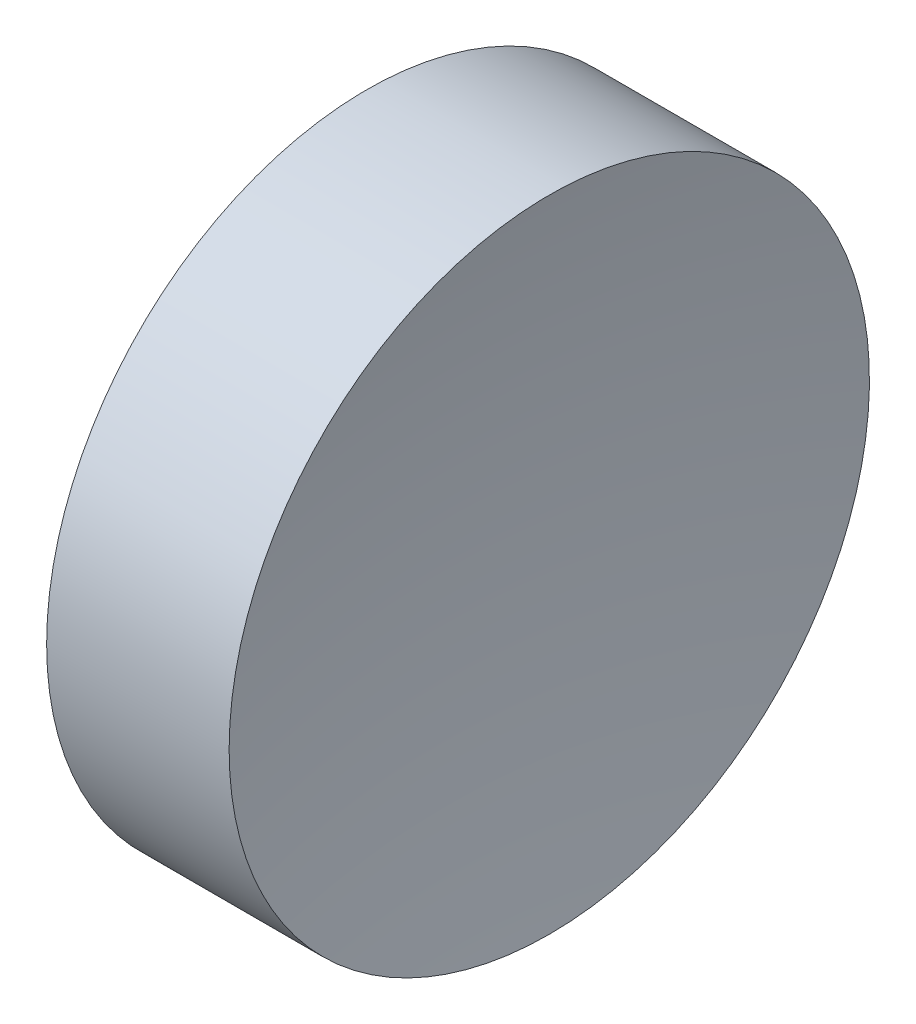
ISO-10303-21;
HEADER;
FILE_DESCRIPTION(('STEP AP214'),'2;1');
FILE_NAME('part.step','',(''),(''),'','','');
FILE_SCHEMA(('AUTOMOTIVE_DESIGN { 1 0 10303 214 1 1 1 1 }'));
ENDSEC;
DATA;
#1=APPLICATION_CONTEXT('core data for automotive mechanical design processes');
#2=APPLICATION_PROTOCOL_DEFINITION('international standard','automotive_design',2000,#1);
#3=PRODUCT_CONTEXT('',#1,'mechanical');
#4=PRODUCT('Part','Part','',(#3));
#5=PRODUCT_RELATED_PRODUCT_CATEGORY('part','',(#4));
#6=PRODUCT_DEFINITION_FORMATION('','',#4);
#7=PRODUCT_DEFINITION_CONTEXT('part definition',#1,'design');
#8=PRODUCT_DEFINITION('design','',#6,#7);
#9=PRODUCT_DEFINITION_SHAPE('','',#8);
#10=(LENGTH_UNIT() NAMED_UNIT(*) SI_UNIT(.MILLI.,.METRE.));
#11=(NAMED_UNIT(*) PLANE_ANGLE_UNIT() SI_UNIT($,.RADIAN.));
#12=(NAMED_UNIT(*) SI_UNIT($,.STERADIAN.) SOLID_ANGLE_UNIT());
#13=UNCERTAINTY_MEASURE_WITH_UNIT(LENGTH_MEASURE(1.E-05),#10,'distance_accuracy_value','');
#14=(GEOMETRIC_REPRESENTATION_CONTEXT(3) GLOBAL_UNCERTAINTY_ASSIGNED_CONTEXT((#13)) GLOBAL_UNIT_ASSIGNED_CONTEXT((#10,
#11,#12)) REPRESENTATION_CONTEXT('',''));
#15=CARTESIAN_POINT('',(0.,0.,0.));
#16=DIRECTION('',(0.,0.,1.));
#17=DIRECTION('',(1.,0.,0.));
#18=AXIS2_PLACEMENT_3D('',#15,#16,#17);
#19=CARTESIAN_POINT('',(191.092655531058,69.3780211233724,0.));
#20=DIRECTION('',(-1.,0.,0.));
#21=DIRECTION('',(0.,-1.,0.));
#22=AXIS2_PLACEMENT_3D('',#19,#20,#21);
#23=SPHERICAL_SURFACE('',#22,70.);
#24=CARTESIAN_POINT('',(122.217768961278,69.3780211233724,0.));
#25=DIRECTION('',(-1.,0.,0.));
#26=DIRECTION('',(0.,0.,1.));
#27=AXIS2_PLACEMENT_3D('',#24,#25,#26);
#28=CIRCLE('',#27,12.5);
#29=CARTESIAN_POINT('',(122.217768961278,69.3780211233724,12.5));
#30=VERTEX_POINT('',#29);
#31=EDGE_CURVE('E10',#30,#30,#28,.T.);
#32=ORIENTED_EDGE('',*,*,#31,.F.);
#33=EDGE_LOOP('',(#32));
#34=FACE_BOUND('',#33,.T.);
#35=ADVANCED_FACE('F35',(#34),#23,.F.);
#36=CARTESIAN_POINT('',(108.985143002165,69.3780211233724,0.));
#37=DIRECTION('',(-1.,0.,0.));
#38=DIRECTION('',(0.,0.,1.));
#39=AXIS2_PLACEMENT_3D('',#36,#37,#38);
#40=CYLINDRICAL_SURFACE('',#39,12.5);
#41=CARTESIAN_POINT('',(115.09265553492,69.3780211233724,0.));
#42=DIRECTION('',(-1.,0.,0.));
#43=DIRECTION('',(0.,0.,1.));
#44=AXIS2_PLACEMENT_3D('',#41,#42,#43);
#45=CIRCLE('',#44,12.5);
#46=CARTESIAN_POINT('',(115.09265553492,69.3780211233724,12.5));
#47=VERTEX_POINT('',#46);
#48=EDGE_CURVE('E41',#47,#47,#45,.T.);
#49=ORIENTED_EDGE('',*,*,#48,.F.);
#50=EDGE_LOOP('',(#49));
#51=FACE_BOUND('',#50,.T.);
#52=ORIENTED_EDGE('',*,*,#31,.T.);
#53=EDGE_LOOP('',(#52));
#54=FACE_BOUND('',#53,.T.);
#55=ADVANCED_FACE('F49',(#51,#54),#40,.T.);
#56=CARTESIAN_POINT('',(115.09265553492,69.3780211233724,0.));
#57=DIRECTION('',(1.,0.,0.));
#58=DIRECTION('',(0.,0.,-1.));
#59=AXIS2_PLACEMENT_3D('',#56,#57,#58);
#60=PLANE('',#59);
#61=ORIENTED_EDGE('',*,*,#48,.T.);
#62=EDGE_LOOP('',(#61));
#63=FACE_BOUND('',#62,.T.);
#64=ADVANCED_FACE('F47',(#63),#60,.F.);
#65=CLOSED_SHELL('',(#35,#55,#64));
#66=MANIFOLD_SOLID_BREP('B2',#65);
#67=ADVANCED_BREP_SHAPE_REPRESENTATION('',(#18,#66),#14);
#68=SHAPE_DEFINITION_REPRESENTATION(#9,#67);
ENDSEC;
END-ISO-10303-21;
